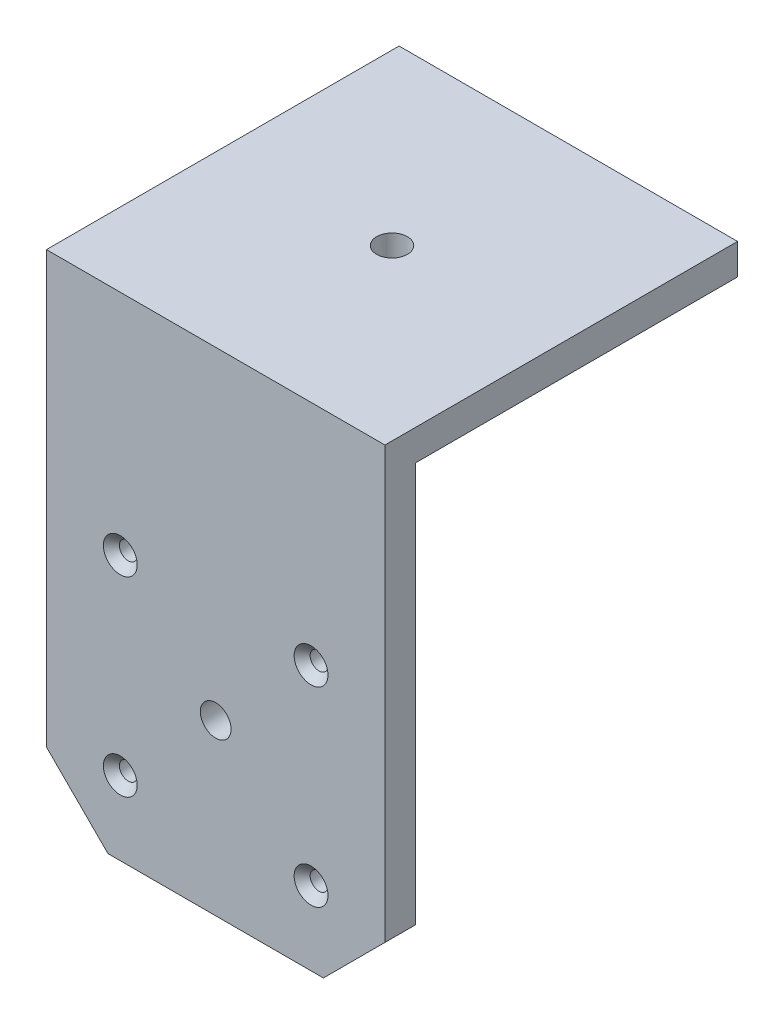
ISO-10303-21;
HEADER;
FILE_DESCRIPTION(('STEP AP214'),'2;1');
FILE_NAME('part.step','',(''),(''),'','','');
FILE_SCHEMA(('AUTOMOTIVE_DESIGN { 1 0 10303 214 1 1 1 1 }'));
ENDSEC;
DATA;
#1=APPLICATION_CONTEXT('core data for automotive mechanical design processes');
#2=APPLICATION_PROTOCOL_DEFINITION('international standard','automotive_design',2000,#1);
#3=PRODUCT_CONTEXT('',#1,'mechanical');
#4=PRODUCT('Part','Part','',(#3));
#5=PRODUCT_RELATED_PRODUCT_CATEGORY('part','',(#4));
#6=PRODUCT_DEFINITION_FORMATION('','',#4);
#7=PRODUCT_DEFINITION_CONTEXT('part definition',#1,'design');
#8=PRODUCT_DEFINITION('design','',#6,#7);
#9=PRODUCT_DEFINITION_SHAPE('','',#8);
#10=(LENGTH_UNIT() NAMED_UNIT(*) SI_UNIT(.MILLI.,.METRE.));
#11=(NAMED_UNIT(*) PLANE_ANGLE_UNIT() SI_UNIT($,.RADIAN.));
#12=(NAMED_UNIT(*) SI_UNIT($,.STERADIAN.) SOLID_ANGLE_UNIT());
#13=UNCERTAINTY_MEASURE_WITH_UNIT(LENGTH_MEASURE(1.E-05),#10,'distance_accuracy_value','');
#14=(GEOMETRIC_REPRESENTATION_CONTEXT(3) GLOBAL_UNCERTAINTY_ASSIGNED_CONTEXT((#13)) GLOBAL_UNIT_ASSIGNED_CONTEXT((#10,
#11,#12)) REPRESENTATION_CONTEXT('',''));
#15=CARTESIAN_POINT('',(0.,0.,0.));
#16=DIRECTION('',(0.,0.,1.));
#17=DIRECTION('',(1.,0.,0.));
#18=AXIS2_PLACEMENT_3D('',#15,#16,#17);
#19=CARTESIAN_POINT('',(-27.5,5.,28.65));
#20=DIRECTION('',(0.,0.,-1.));
#21=DIRECTION('',(-1.,0.,0.));
#22=AXIS2_PLACEMENT_3D('',#19,#20,#21);
#23=PLANE('',#22);
#24=DIRECTION('',(-1.,0.,0.));
#25=VECTOR('',#24,1.);
#26=CARTESIAN_POINT('',(-27.5,-75.,28.65));
#27=LINE('',#26,#25);
#28=CARTESIAN_POINT('',(17.5,-75.,28.65));
#29=VERTEX_POINT('',#28);
#30=CARTESIAN_POINT('',(-17.5,-75.,28.65));
#31=VERTEX_POINT('',#30);
#32=EDGE_CURVE('E191',#29,#31,#27,.T.);
#33=ORIENTED_EDGE('',*,*,#32,.F.);
#34=DIRECTION('',(-0.707106781186547,-0.707106781186549,0.));
#35=VECTOR('',#34,1.);
#36=CARTESIAN_POINT('',(27.5,-65.,28.65));
#37=LINE('',#36,#35);
#38=CARTESIAN_POINT('',(27.5,-65.,28.65));
#39=VERTEX_POINT('',#38);
#40=EDGE_CURVE('E51',#39,#29,#37,.T.);
#41=ORIENTED_EDGE('',*,*,#40,.F.);
#42=DIRECTION('',(0.,-1.,0.));
#43=VECTOR('',#42,1.);
#44=CARTESIAN_POINT('',(27.5,5.,28.65));
#45=LINE('',#44,#43);
#46=CARTESIAN_POINT('',(27.5,5.,28.65));
#47=VERTEX_POINT('',#46);
#48=EDGE_CURVE('E271',#47,#39,#45,.T.);
#49=ORIENTED_EDGE('',*,*,#48,.F.);
#50=DIRECTION('',(1.,0.,0.));
#51=VECTOR('',#50,1.);
#52=CARTESIAN_POINT('',(-27.5,5.,28.65));
#53=LINE('',#52,#51);
#54=CARTESIAN_POINT('',(-27.5,5.,28.65));
#55=VERTEX_POINT('',#54);
#56=EDGE_CURVE('E278',#55,#47,#53,.T.);
#57=ORIENTED_EDGE('',*,*,#56,.F.);
#58=DIRECTION('',(0.,-1.,0.));
#59=VECTOR('',#58,1.);
#60=CARTESIAN_POINT('',(-27.5,5.,28.65));
#61=LINE('',#60,#59);
#62=CARTESIAN_POINT('',(-27.5,-65.,28.65));
#63=VERTEX_POINT('',#62);
#64=EDGE_CURVE('E283',#55,#63,#61,.T.);
#65=ORIENTED_EDGE('',*,*,#64,.T.);
#66=DIRECTION('',(-0.707106781186548,0.707106781186547,0.));
#67=VECTOR('',#66,1.);
#68=CARTESIAN_POINT('',(-17.5,-75.,28.65));
#69=LINE('',#68,#67);
#70=EDGE_CURVE('E180',#31,#63,#69,.T.);
#71=ORIENTED_EDGE('',*,*,#70,.F.);
#72=EDGE_LOOP('',(#33,#41,#49,#57,#65,#71));
#73=FACE_BOUND('',#72,.T.);
#74=CARTESIAN_POINT('',(0.,-47.5,28.65));
#75=DIRECTION('',(0.,0.,1.));
#76=DIRECTION('',(1.,0.,0.));
#77=AXIS2_PLACEMENT_3D('',#74,#75,#76);
#78=CIRCLE('',#77,2.5);
#79=CARTESIAN_POINT('',(2.5,-47.5,28.65));
#80=VERTEX_POINT('',#79);
#81=EDGE_CURVE('E166',#80,#80,#78,.T.);
#82=ORIENTED_EDGE('',*,*,#81,.F.);
#83=EDGE_LOOP('',(#82));
#84=FACE_BOUND('',#83,.T.);
#85=CARTESIAN_POINT('',(15.5,-63.,28.65));
#86=DIRECTION('',(0.,0.,1.));
#87=DIRECTION('',(1.,0.,0.));
#88=AXIS2_PLACEMENT_3D('',#85,#86,#87);
#89=CIRCLE('',#88,2.75);
#90=CARTESIAN_POINT('',(18.25,-63.,28.65));
#91=VERTEX_POINT('',#90);
#92=EDGE_CURVE('E154',#91,#91,#89,.T.);
#93=ORIENTED_EDGE('',*,*,#92,.F.);
#94=EDGE_LOOP('',(#93));
#95=FACE_BOUND('',#94,.T.);
#96=CARTESIAN_POINT('',(-15.5,-63.,28.65));
#97=DIRECTION('',(0.,0.,1.));
#98=DIRECTION('',(1.,0.,0.));
#99=AXIS2_PLACEMENT_3D('',#96,#97,#98);
#100=CIRCLE('',#99,2.75);
#101=CARTESIAN_POINT('',(-12.75,-63.,28.65));
#102=VERTEX_POINT('',#101);
#103=EDGE_CURVE('E145',#102,#102,#100,.T.);
#104=ORIENTED_EDGE('',*,*,#103,.F.);
#105=EDGE_LOOP('',(#104));
#106=FACE_BOUND('',#105,.T.);
#107=CARTESIAN_POINT('',(15.5,-32.,28.65));
#108=DIRECTION('',(0.,0.,1.));
#109=DIRECTION('',(1.,0.,0.));
#110=AXIS2_PLACEMENT_3D('',#107,#108,#109);
#111=CIRCLE('',#110,2.75);
#112=CARTESIAN_POINT('',(18.25,-32.,28.65));
#113=VERTEX_POINT('',#112);
#114=EDGE_CURVE('E136',#113,#113,#111,.T.);
#115=ORIENTED_EDGE('',*,*,#114,.F.);
#116=EDGE_LOOP('',(#115));
#117=FACE_BOUND('',#116,.T.);
#118=CARTESIAN_POINT('',(-15.5,-32.,28.65));
#119=DIRECTION('',(0.,0.,1.));
#120=DIRECTION('',(1.,0.,0.));
#121=AXIS2_PLACEMENT_3D('',#118,#119,#120);
#122=CIRCLE('',#121,2.75);
#123=CARTESIAN_POINT('',(-12.75,-32.,28.65));
#124=VERTEX_POINT('',#123);
#125=EDGE_CURVE('E127',#124,#124,#122,.T.);
#126=ORIENTED_EDGE('',*,*,#125,.F.);
#127=EDGE_LOOP('',(#126));
#128=FACE_BOUND('',#127,.T.);
#129=ADVANCED_FACE('F33',(#73,#84,#95,#106,#117,#128),#23,.F.);
#130=CARTESIAN_POINT('',(0.,0.,0.));
#131=DIRECTION('',(0.,1.,0.));
#132=DIRECTION('',(0.,0.,1.));
#133=AXIS2_PLACEMENT_3D('',#130,#131,#132);
#134=PLANE('',#133);
#135=CARTESIAN_POINT('',(15.5000000000002,0.,-16.15));
#136=DIRECTION('',(0.,-1.,0.));
#137=DIRECTION('',(0.,0.,-1.));
#138=AXIS2_PLACEMENT_3D('',#135,#136,#137);
#139=CIRCLE('',#138,1.4351);
#140=CARTESIAN_POINT('',(15.5000000000002,0.,-17.5851));
#141=VERTEX_POINT('',#140);
#142=EDGE_CURVE('E117',#141,#141,#139,.T.);
#143=ORIENTED_EDGE('',*,*,#142,.F.);
#144=EDGE_LOOP('',(#143));
#145=FACE_BOUND('',#144,.T.);
#146=CARTESIAN_POINT('',(-15.4999999999998,0.,-16.15));
#147=DIRECTION('',(0.,-1.,0.));
#148=DIRECTION('',(0.,0.,-1.));
#149=AXIS2_PLACEMENT_3D('',#146,#147,#148);
#150=CIRCLE('',#149,1.4351);
#151=CARTESIAN_POINT('',(-15.4999999999998,0.,-17.5851));
#152=VERTEX_POINT('',#151);
#153=EDGE_CURVE('E116',#152,#152,#150,.T.);
#154=ORIENTED_EDGE('',*,*,#153,.F.);
#155=EDGE_LOOP('',(#154));
#156=FACE_BOUND('',#155,.T.);
#157=CARTESIAN_POINT('',(0.,0.,0.));
#158=DIRECTION('',(0.,1.,0.));
#159=DIRECTION('',(0.,0.,1.));
#160=AXIS2_PLACEMENT_3D('',#157,#158,#159);
#161=CIRCLE('',#160,2.5);
#162=CARTESIAN_POINT('',(0.,0.,2.5));
#163=VERTEX_POINT('',#162);
#164=EDGE_CURVE('E209',#163,#163,#161,.T.);
#165=ORIENTED_EDGE('',*,*,#164,.T.);
#166=EDGE_LOOP('',(#165));
#167=FACE_BOUND('',#166,.T.);
#168=DIRECTION('',(0.,0.,1.));
#169=VECTOR('',#168,1.);
#170=CARTESIAN_POINT('',(-27.5,0.,-28.65));
#171=LINE('',#170,#169);
#172=CARTESIAN_POINT('',(-27.5,0.,-28.65));
#173=VERTEX_POINT('',#172);
#174=CARTESIAN_POINT('',(-27.5,0.,23.65));
#175=VERTEX_POINT('',#174);
#176=EDGE_CURVE('E206',#173,#175,#171,.T.);
#177=ORIENTED_EDGE('',*,*,#176,.F.);
#178=DIRECTION('',(1.,0.,0.));
#179=VECTOR('',#178,1.);
#180=CARTESIAN_POINT('',(-27.5,0.,-28.65));
#181=LINE('',#180,#179);
#182=CARTESIAN_POINT('',(27.5,0.,-28.65));
#183=VERTEX_POINT('',#182);
#184=EDGE_CURVE('E163',#173,#183,#181,.T.);
#185=ORIENTED_EDGE('',*,*,#184,.T.);
#186=DIRECTION('',(0.,0.,-1.));
#187=VECTOR('',#186,1.);
#188=CARTESIAN_POINT('',(27.5,0.,-28.65));
#189=LINE('',#188,#187);
#190=CARTESIAN_POINT('',(27.5,0.,23.65));
#191=VERTEX_POINT('',#190);
#192=EDGE_CURVE('E200',#191,#183,#189,.T.);
#193=ORIENTED_EDGE('',*,*,#192,.F.);
#194=DIRECTION('',(1.,0.,0.));
#195=VECTOR('',#194,1.);
#196=CARTESIAN_POINT('',(-27.5,0.,23.65));
#197=LINE('',#196,#195);
#198=EDGE_CURVE('E186',#175,#191,#197,.T.);
#199=ORIENTED_EDGE('',*,*,#198,.F.);
#200=EDGE_LOOP('',(#177,#185,#193,#199));
#201=FACE_BOUND('',#200,.T.);
#202=ADVANCED_FACE('F223',(#145,#156,#167,#201),#134,.F.);
#203=CARTESIAN_POINT('',(0.,5.,0.));
#204=DIRECTION('',(0.,1.,0.));
#205=DIRECTION('',(0.,0.,1.));
#206=AXIS2_PLACEMENT_3D('',#203,#204,#205);
#207=PLANE('',#206);
#208=DIRECTION('',(0.,0.,-1.));
#209=VECTOR('',#208,1.);
#210=CARTESIAN_POINT('',(27.5,5.,-28.65));
#211=LINE('',#210,#209);
#212=CARTESIAN_POINT('',(27.5,5.,-28.65));
#213=VERTEX_POINT('',#212);
#214=EDGE_CURVE('E269',#47,#213,#211,.T.);
#215=ORIENTED_EDGE('',*,*,#214,.T.);
#216=DIRECTION('',(-1.,0.,0.));
#217=VECTOR('',#216,1.);
#218=CARTESIAN_POINT('',(-27.5,5.,-28.65));
#219=LINE('',#218,#217);
#220=CARTESIAN_POINT('',(-27.5,5.,-28.65));
#221=VERTEX_POINT('',#220);
#222=EDGE_CURVE('E266',#213,#221,#219,.T.);
#223=ORIENTED_EDGE('',*,*,#222,.T.);
#224=DIRECTION('',(0.,0.,1.));
#225=VECTOR('',#224,1.);
#226=CARTESIAN_POINT('',(-27.5,5.,-28.65));
#227=LINE('',#226,#225);
#228=EDGE_CURVE('E274',#221,#55,#227,.T.);
#229=ORIENTED_EDGE('',*,*,#228,.T.);
#230=ORIENTED_EDGE('',*,*,#56,.T.);
#231=EDGE_LOOP('',(#215,#223,#229,#230));
#232=FACE_BOUND('',#231,.T.);
#233=CARTESIAN_POINT('',(0.,5.,0.));
#234=DIRECTION('',(0.,1.,0.));
#235=DIRECTION('',(0.,0.,1.));
#236=AXIS2_PLACEMENT_3D('',#233,#234,#235);
#237=CIRCLE('',#236,2.5);
#238=CARTESIAN_POINT('',(0.,5.,2.5));
#239=VERTEX_POINT('',#238);
#240=EDGE_CURVE('E195',#239,#239,#237,.T.);
#241=ORIENTED_EDGE('',*,*,#240,.F.);
#242=EDGE_LOOP('',(#241));
#243=FACE_BOUND('',#242,.T.);
#244=ADVANCED_FACE('F250',(#232,#243),#207,.T.);
#245=CARTESIAN_POINT('',(27.5,5.,-28.65));
#246=DIRECTION('',(-1.,0.,0.));
#247=DIRECTION('',(0.,0.,1.));
#248=AXIS2_PLACEMENT_3D('',#245,#246,#247);
#249=PLANE('',#248);
#250=ORIENTED_EDGE('',*,*,#192,.T.);
#251=DIRECTION('',(0.,-1.,0.));
#252=VECTOR('',#251,1.);
#253=CARTESIAN_POINT('',(27.5,5.,-28.65));
#254=LINE('',#253,#252);
#255=EDGE_CURVE('E11',#213,#183,#254,.T.);
#256=ORIENTED_EDGE('',*,*,#255,.F.);
#257=ORIENTED_EDGE('',*,*,#214,.F.);
#258=ORIENTED_EDGE('',*,*,#48,.T.);
#259=DIRECTION('',(0.,0.,1.));
#260=VECTOR('',#259,1.);
#261=CARTESIAN_POINT('',(27.5,-65.,-28.651));
#262=LINE('',#261,#260);
#263=CARTESIAN_POINT('',(27.5,-65.,23.65));
#264=VERTEX_POINT('',#263);
#265=EDGE_CURVE('E175',#264,#39,#262,.T.);
#266=ORIENTED_EDGE('',*,*,#265,.F.);
#267=DIRECTION('',(0.,1.,0.));
#268=VECTOR('',#267,1.);
#269=CARTESIAN_POINT('',(27.5,-75.,23.65));
#270=LINE('',#269,#268);
#271=EDGE_CURVE('E37',#264,#191,#270,.T.);
#272=ORIENTED_EDGE('',*,*,#271,.T.);
#273=EDGE_LOOP('',(#250,#256,#257,#258,#266,#272));
#274=FACE_BOUND('',#273,.T.);
#275=ADVANCED_FACE('F35',(#274),#249,.F.);
#276=CARTESIAN_POINT('',(-27.5,5.,-28.65));
#277=DIRECTION('',(0.,0.,1.));
#278=DIRECTION('',(1.,0.,0.));
#279=AXIS2_PLACEMENT_3D('',#276,#277,#278);
#280=PLANE('',#279);
#281=ORIENTED_EDGE('',*,*,#255,.T.);
#282=ORIENTED_EDGE('',*,*,#184,.F.);
#283=DIRECTION('',(0.,-1.,0.));
#284=VECTOR('',#283,1.);
#285=CARTESIAN_POINT('',(-27.5,5.,-28.65));
#286=LINE('',#285,#284);
#287=EDGE_CURVE('E43',#221,#173,#286,.T.);
#288=ORIENTED_EDGE('',*,*,#287,.F.);
#289=ORIENTED_EDGE('',*,*,#222,.F.);
#290=EDGE_LOOP('',(#281,#282,#288,#289));
#291=FACE_BOUND('',#290,.T.);
#292=ADVANCED_FACE('F257',(#291),#280,.F.);
#293=CARTESIAN_POINT('',(-27.5,5.,-28.65));
#294=DIRECTION('',(1.,0.,0.));
#295=DIRECTION('',(0.,0.,-1.));
#296=AXIS2_PLACEMENT_3D('',#293,#294,#295);
#297=PLANE('',#296);
#298=ORIENTED_EDGE('',*,*,#287,.T.);
#299=ORIENTED_EDGE('',*,*,#176,.T.);
#300=DIRECTION('',(0.,1.,0.));
#301=VECTOR('',#300,1.);
#302=CARTESIAN_POINT('',(-27.5,-75.,23.65));
#303=LINE('',#302,#301);
#304=CARTESIAN_POINT('',(-27.5,-65.,23.65));
#305=VERTEX_POINT('',#304);
#306=EDGE_CURVE('E208',#305,#175,#303,.T.);
#307=ORIENTED_EDGE('',*,*,#306,.F.);
#308=DIRECTION('',(0.,0.,1.));
#309=VECTOR('',#308,1.);
#310=CARTESIAN_POINT('',(-27.5,-65.,-28.651));
#311=LINE('',#310,#309);
#312=EDGE_CURVE('E183',#305,#63,#311,.T.);
#313=ORIENTED_EDGE('',*,*,#312,.T.);
#314=ORIENTED_EDGE('',*,*,#64,.F.);
#315=ORIENTED_EDGE('',*,*,#228,.F.);
#316=EDGE_LOOP('',(#298,#299,#307,#313,#314,#315));
#317=FACE_BOUND('',#316,.T.);
#318=ADVANCED_FACE('F240',(#317),#297,.F.);
#319=CARTESIAN_POINT('',(0.,5.,0.));
#320=DIRECTION('',(0.,-1.,0.));
#321=DIRECTION('',(0.,0.,-1.));
#322=AXIS2_PLACEMENT_3D('',#319,#320,#321);
#323=CYLINDRICAL_SURFACE('',#322,2.5);
#324=ORIENTED_EDGE('',*,*,#240,.T.);
#325=EDGE_LOOP('',(#324));
#326=FACE_BOUND('',#325,.T.);
#327=ORIENTED_EDGE('',*,*,#164,.F.);
#328=EDGE_LOOP('',(#327));
#329=FACE_BOUND('',#328,.T.);
#330=ADVANCED_FACE('F228',(#326,#329),#323,.F.);
#331=CARTESIAN_POINT('',(-27.5,-75.,23.65));
#332=DIRECTION('',(0.,0.,1.));
#333=DIRECTION('',(1.,0.,0.));
#334=AXIS2_PLACEMENT_3D('',#331,#332,#333);
#335=PLANE('',#334);
#336=CARTESIAN_POINT('',(-15.5,-32.,23.65));
#337=DIRECTION('',(0.,0.,1.));
#338=DIRECTION('',(1.,0.,0.));
#339=AXIS2_PLACEMENT_3D('',#336,#337,#338);
#340=CIRCLE('',#339,1.44999999999999);
#341=CARTESIAN_POINT('',(-14.05,-32.,23.65));
#342=VERTEX_POINT('',#341);
#343=EDGE_CURVE('E133',#342,#342,#340,.T.);
#344=ORIENTED_EDGE('',*,*,#343,.T.);
#345=EDGE_LOOP('',(#344));
#346=FACE_BOUND('',#345,.T.);
#347=CARTESIAN_POINT('',(15.5,-32.,23.65));
#348=DIRECTION('',(0.,0.,1.));
#349=DIRECTION('',(1.,0.,0.));
#350=AXIS2_PLACEMENT_3D('',#347,#348,#349);
#351=CIRCLE('',#350,1.44999999999999);
#352=CARTESIAN_POINT('',(16.95,-32.,23.65));
#353=VERTEX_POINT('',#352);
#354=EDGE_CURVE('E142',#353,#353,#351,.T.);
#355=ORIENTED_EDGE('',*,*,#354,.T.);
#356=EDGE_LOOP('',(#355));
#357=FACE_BOUND('',#356,.T.);
#358=CARTESIAN_POINT('',(-15.5,-63.,23.65));
#359=DIRECTION('',(0.,0.,1.));
#360=DIRECTION('',(1.,0.,0.));
#361=AXIS2_PLACEMENT_3D('',#358,#359,#360);
#362=CIRCLE('',#361,1.44999999999999);
#363=CARTESIAN_POINT('',(-14.05,-63.,23.65));
#364=VERTEX_POINT('',#363);
#365=EDGE_CURVE('E151',#364,#364,#362,.T.);
#366=ORIENTED_EDGE('',*,*,#365,.T.);
#367=EDGE_LOOP('',(#366));
#368=FACE_BOUND('',#367,.T.);
#369=CARTESIAN_POINT('',(15.5,-63.,23.65));
#370=DIRECTION('',(0.,0.,1.));
#371=DIRECTION('',(1.,0.,0.));
#372=AXIS2_PLACEMENT_3D('',#369,#370,#371);
#373=CIRCLE('',#372,1.44999999999999);
#374=CARTESIAN_POINT('',(16.95,-63.,23.65));
#375=VERTEX_POINT('',#374);
#376=EDGE_CURVE('E160',#375,#375,#373,.T.);
#377=ORIENTED_EDGE('',*,*,#376,.T.);
#378=EDGE_LOOP('',(#377));
#379=FACE_BOUND('',#378,.T.);
#380=CARTESIAN_POINT('',(0.,-47.5,23.65));
#381=DIRECTION('',(0.,0.,1.));
#382=DIRECTION('',(1.,0.,0.));
#383=AXIS2_PLACEMENT_3D('',#380,#381,#382);
#384=CIRCLE('',#383,2.5);
#385=CARTESIAN_POINT('',(2.5,-47.5,23.65));
#386=VERTEX_POINT('',#385);
#387=EDGE_CURVE('E169',#386,#386,#384,.F.);
#388=ORIENTED_EDGE('',*,*,#387,.F.);
#389=EDGE_LOOP('',(#388));
#390=FACE_BOUND('',#389,.T.);
#391=ORIENTED_EDGE('',*,*,#271,.F.);
#392=DIRECTION('',(0.707106781186547,0.707106781186548,0.));
#393=VECTOR('',#392,1.);
#394=CARTESIAN_POINT('',(27.5,-65.,23.65));
#395=LINE('',#394,#393);
#396=CARTESIAN_POINT('',(17.5,-75.,23.65));
#397=VERTEX_POINT('',#396);
#398=EDGE_CURVE('E172',#397,#264,#395,.T.);
#399=ORIENTED_EDGE('',*,*,#398,.F.);
#400=DIRECTION('',(1.,0.,0.));
#401=VECTOR('',#400,1.);
#402=CARTESIAN_POINT('',(-27.5,-75.,23.65));
#403=LINE('',#402,#401);
#404=CARTESIAN_POINT('',(-17.5,-75.,23.65));
#405=VERTEX_POINT('',#404);
#406=EDGE_CURVE('E188',#405,#397,#403,.T.);
#407=ORIENTED_EDGE('',*,*,#406,.F.);
#408=DIRECTION('',(0.707106781186548,-0.707106781186547,0.));
#409=VECTOR('',#408,1.);
#410=CARTESIAN_POINT('',(-17.5,-75.,23.65));
#411=LINE('',#410,#409);
#412=EDGE_CURVE('E59',#305,#405,#411,.T.);
#413=ORIENTED_EDGE('',*,*,#412,.F.);
#414=ORIENTED_EDGE('',*,*,#306,.T.);
#415=ORIENTED_EDGE('',*,*,#198,.T.);
#416=EDGE_LOOP('',(#391,#399,#407,#413,#414,#415));
#417=FACE_BOUND('',#416,.T.);
#418=ADVANCED_FACE('F225',(#346,#357,#368,#379,#390,#417),#335,.F.);
#419=CARTESIAN_POINT('',(0.,-75.,0.));
#420=DIRECTION('',(0.,-1.,0.));
#421=DIRECTION('',(0.,0.,-1.));
#422=AXIS2_PLACEMENT_3D('',#419,#420,#421);
#423=PLANE('',#422);
#424=DIRECTION('',(0.,0.,1.));
#425=VECTOR('',#424,1.);
#426=CARTESIAN_POINT('',(17.5,-75.,-28.651));
#427=LINE('',#426,#425);
#428=EDGE_CURVE('E176',#397,#29,#427,.T.);
#429=ORIENTED_EDGE('',*,*,#428,.T.);
#430=ORIENTED_EDGE('',*,*,#32,.T.);
#431=DIRECTION('',(0.,0.,1.));
#432=VECTOR('',#431,1.);
#433=CARTESIAN_POINT('',(-17.5,-75.,-28.651));
#434=LINE('',#433,#432);
#435=EDGE_CURVE('E182',#405,#31,#434,.T.);
#436=ORIENTED_EDGE('',*,*,#435,.F.);
#437=ORIENTED_EDGE('',*,*,#406,.T.);
#438=EDGE_LOOP('',(#429,#430,#436,#437));
#439=FACE_BOUND('',#438,.T.);
#440=ADVANCED_FACE('F227',(#439),#423,.T.);
#441=CARTESIAN_POINT('',(-17.5,-75.,-28.651));
#442=DIRECTION('',(0.707106781186547,0.707106781186548,0.));
#443=DIRECTION('',(-0.707106781186548,0.707106781186547,0.));
#444=AXIS2_PLACEMENT_3D('',#441,#442,#443);
#445=PLANE('',#444);
#446=ORIENTED_EDGE('',*,*,#412,.T.);
#447=ORIENTED_EDGE('',*,*,#435,.T.);
#448=ORIENTED_EDGE('',*,*,#70,.T.);
#449=ORIENTED_EDGE('',*,*,#312,.F.);
#450=EDGE_LOOP('',(#446,#447,#448,#449));
#451=FACE_BOUND('',#450,.T.);
#452=ADVANCED_FACE('F236',(#451),#445,.F.);
#453=CARTESIAN_POINT('',(27.5,-65.,-28.651));
#454=DIRECTION('',(-0.707106781186548,0.707106781186547,0.));
#455=DIRECTION('',(-0.707106781186547,-0.707106781186548,0.));
#456=AXIS2_PLACEMENT_3D('',#453,#454,#455);
#457=PLANE('',#456);
#458=ORIENTED_EDGE('',*,*,#398,.T.);
#459=ORIENTED_EDGE('',*,*,#265,.T.);
#460=ORIENTED_EDGE('',*,*,#40,.T.);
#461=ORIENTED_EDGE('',*,*,#428,.F.);
#462=EDGE_LOOP('',(#458,#459,#460,#461));
#463=FACE_BOUND('',#462,.T.);
#464=ADVANCED_FACE('F292',(#463),#457,.F.);
#465=CARTESIAN_POINT('',(0.,-47.5,-28.651));
#466=DIRECTION('',(0.,0.,1.));
#467=DIRECTION('',(1.,0.,0.));
#468=AXIS2_PLACEMENT_3D('',#465,#466,#467);
#469=CYLINDRICAL_SURFACE('',#468,2.5);
#470=ORIENTED_EDGE('',*,*,#81,.T.);
#471=EDGE_LOOP('',(#470));
#472=FACE_BOUND('',#471,.T.);
#473=ORIENTED_EDGE('',*,*,#387,.T.);
#474=EDGE_LOOP('',(#473));
#475=FACE_BOUND('',#474,.T.);
#476=ADVANCED_FACE('F294',(#472,#475),#469,.F.);
#477=CARTESIAN_POINT('',(15.5,-63.,28.65));
#478=DIRECTION('',(0.,0.,1.));
#479=DIRECTION('',(1.,0.,0.));
#480=AXIS2_PLACEMENT_3D('',#477,#478,#479);
#481=CYLINDRICAL_SURFACE('',#480,1.44999999999999);
#482=ORIENTED_EDGE('',*,*,#376,.F.);
#483=EDGE_LOOP('',(#482));
#484=FACE_BOUND('',#483,.T.);
#485=CARTESIAN_POINT('',(15.5,-63.,27.35));
#486=DIRECTION('',(0.,0.,1.));
#487=DIRECTION('',(1.,0.,0.));
#488=AXIS2_PLACEMENT_3D('',#485,#486,#487);
#489=CIRCLE('',#488,1.44999999999999);
#490=CARTESIAN_POINT('',(16.95,-63.,27.35));
#491=VERTEX_POINT('',#490);
#492=EDGE_CURVE('E157',#491,#491,#489,.T.);
#493=ORIENTED_EDGE('',*,*,#492,.T.);
#494=EDGE_LOOP('',(#493));
#495=FACE_BOUND('',#494,.T.);
#496=ADVANCED_FACE('F300',(#484,#495),#481,.F.);
#497=CARTESIAN_POINT('',(15.5,-63.,28.65));
#498=DIRECTION('',(0.,0.,1.));
#499=DIRECTION('',(1.,0.,0.));
#500=AXIS2_PLACEMENT_3D('',#497,#498,#499);
#501=CONICAL_SURFACE('',#500,2.75,0.785398163397448);
#502=ORIENTED_EDGE('',*,*,#492,.F.);
#503=EDGE_LOOP('',(#502));
#504=FACE_BOUND('',#503,.T.);
#505=ORIENTED_EDGE('',*,*,#92,.T.);
#506=EDGE_LOOP('',(#505));
#507=FACE_BOUND('',#506,.T.);
#508=ADVANCED_FACE('F307',(#504,#507),#501,.F.);
#509=CARTESIAN_POINT('',(-15.5,-63.,28.65));
#510=DIRECTION('',(0.,0.,1.));
#511=DIRECTION('',(1.,0.,0.));
#512=AXIS2_PLACEMENT_3D('',#509,#510,#511);
#513=CYLINDRICAL_SURFACE('',#512,1.44999999999999);
#514=ORIENTED_EDGE('',*,*,#365,.F.);
#515=EDGE_LOOP('',(#514));
#516=FACE_BOUND('',#515,.T.);
#517=CARTESIAN_POINT('',(-15.5,-63.,27.35));
#518=DIRECTION('',(0.,0.,1.));
#519=DIRECTION('',(1.,0.,0.));
#520=AXIS2_PLACEMENT_3D('',#517,#518,#519);
#521=CIRCLE('',#520,1.44999999999999);
#522=CARTESIAN_POINT('',(-14.05,-63.,27.35));
#523=VERTEX_POINT('',#522);
#524=EDGE_CURVE('E148',#523,#523,#521,.T.);
#525=ORIENTED_EDGE('',*,*,#524,.T.);
#526=EDGE_LOOP('',(#525));
#527=FACE_BOUND('',#526,.T.);
#528=ADVANCED_FACE('F311',(#516,#527),#513,.F.);
#529=CARTESIAN_POINT('',(-15.5,-63.,28.65));
#530=DIRECTION('',(0.,0.,1.));
#531=DIRECTION('',(1.,0.,0.));
#532=AXIS2_PLACEMENT_3D('',#529,#530,#531);
#533=CONICAL_SURFACE('',#532,2.75,0.785398163397449);
#534=ORIENTED_EDGE('',*,*,#524,.F.);
#535=EDGE_LOOP('',(#534));
#536=FACE_BOUND('',#535,.T.);
#537=ORIENTED_EDGE('',*,*,#103,.T.);
#538=EDGE_LOOP('',(#537));
#539=FACE_BOUND('',#538,.T.);
#540=ADVANCED_FACE('F315',(#536,#539),#533,.F.);
#541=CARTESIAN_POINT('',(15.5,-32.,28.65));
#542=DIRECTION('',(0.,0.,1.));
#543=DIRECTION('',(1.,0.,0.));
#544=AXIS2_PLACEMENT_3D('',#541,#542,#543);
#545=CYLINDRICAL_SURFACE('',#544,1.44999999999999);
#546=ORIENTED_EDGE('',*,*,#354,.F.);
#547=EDGE_LOOP('',(#546));
#548=FACE_BOUND('',#547,.T.);
#549=CARTESIAN_POINT('',(15.5,-32.,27.35));
#550=DIRECTION('',(0.,0.,1.));
#551=DIRECTION('',(1.,0.,0.));
#552=AXIS2_PLACEMENT_3D('',#549,#550,#551);
#553=CIRCLE('',#552,1.44999999999999);
#554=CARTESIAN_POINT('',(16.95,-32.,27.35));
#555=VERTEX_POINT('',#554);
#556=EDGE_CURVE('E139',#555,#555,#553,.T.);
#557=ORIENTED_EDGE('',*,*,#556,.T.);
#558=EDGE_LOOP('',(#557));
#559=FACE_BOUND('',#558,.T.);
#560=ADVANCED_FACE('F319',(#548,#559),#545,.F.);
#561=CARTESIAN_POINT('',(15.5,-32.,28.65));
#562=DIRECTION('',(0.,0.,1.));
#563=DIRECTION('',(1.,0.,0.));
#564=AXIS2_PLACEMENT_3D('',#561,#562,#563);
#565=CONICAL_SURFACE('',#564,2.75,0.785398163397448);
#566=ORIENTED_EDGE('',*,*,#556,.F.);
#567=EDGE_LOOP('',(#566));
#568=FACE_BOUND('',#567,.T.);
#569=ORIENTED_EDGE('',*,*,#114,.T.);
#570=EDGE_LOOP('',(#569));
#571=FACE_BOUND('',#570,.T.);
#572=ADVANCED_FACE('F323',(#568,#571),#565,.F.);
#573=CARTESIAN_POINT('',(-15.5,-32.,28.65));
#574=DIRECTION('',(0.,0.,1.));
#575=DIRECTION('',(1.,0.,0.));
#576=AXIS2_PLACEMENT_3D('',#573,#574,#575);
#577=CYLINDRICAL_SURFACE('',#576,1.44999999999999);
#578=ORIENTED_EDGE('',*,*,#343,.F.);
#579=EDGE_LOOP('',(#578));
#580=FACE_BOUND('',#579,.T.);
#581=CARTESIAN_POINT('',(-15.5,-32.,27.35));
#582=DIRECTION('',(0.,0.,1.));
#583=DIRECTION('',(1.,0.,0.));
#584=AXIS2_PLACEMENT_3D('',#581,#582,#583);
#585=CIRCLE('',#584,1.44999999999999);
#586=CARTESIAN_POINT('',(-14.05,-32.,27.35));
#587=VERTEX_POINT('',#586);
#588=EDGE_CURVE('E130',#587,#587,#585,.T.);
#589=ORIENTED_EDGE('',*,*,#588,.T.);
#590=EDGE_LOOP('',(#589));
#591=FACE_BOUND('',#590,.T.);
#592=ADVANCED_FACE('F327',(#580,#591),#577,.F.);
#593=CARTESIAN_POINT('',(-15.5,-32.,28.65));
#594=DIRECTION('',(0.,0.,1.));
#595=DIRECTION('',(1.,0.,0.));
#596=AXIS2_PLACEMENT_3D('',#593,#594,#595);
#597=CONICAL_SURFACE('',#596,2.75,0.785398163397449);
#598=ORIENTED_EDGE('',*,*,#588,.F.);
#599=EDGE_LOOP('',(#598));
#600=FACE_BOUND('',#599,.T.);
#601=ORIENTED_EDGE('',*,*,#125,.T.);
#602=EDGE_LOOP('',(#601));
#603=FACE_BOUND('',#602,.T.);
#604=ADVANCED_FACE('F331',(#600,#603),#597,.F.);
#605=CARTESIAN_POINT('',(-15.4999999999998,3.5,-16.15));
#606=DIRECTION('',(0.,-1.,0.));
#607=DIRECTION('',(0.,0.,-1.));
#608=AXIS2_PLACEMENT_3D('',#605,#606,#607);
#609=CONICAL_SURFACE('',#608,1.4351,1.02974425867665);
#610=CARTESIAN_POINT('',(-15.4999999999998,4.36229507436645,-16.15));
#611=VERTEX_POINT('',#610);
#612=VERTEX_LOOP('',#611);
#613=FACE_BOUND('',#612,.T.);
#614=CARTESIAN_POINT('',(-15.4999999999998,3.5,-16.15));
#615=DIRECTION('',(0.,-1.,0.));
#616=DIRECTION('',(0.,0.,-1.));
#617=AXIS2_PLACEMENT_3D('',#614,#615,#616);
#618=CIRCLE('',#617,1.4351);
#619=CARTESIAN_POINT('',(-15.4999999999998,3.5,-17.5851));
#620=VERTEX_POINT('',#619);
#621=EDGE_CURVE('E120',#620,#620,#618,.T.);
#622=ORIENTED_EDGE('',*,*,#621,.T.);
#623=EDGE_LOOP('',(#622));
#624=FACE_BOUND('',#623,.T.);
#625=ADVANCED_FACE('F335',(#613,#624),#609,.F.);
#626=CARTESIAN_POINT('',(-15.4999999999998,0.,-16.15));
#627=DIRECTION('',(0.,-1.,0.));
#628=DIRECTION('',(0.,0.,-1.));
#629=AXIS2_PLACEMENT_3D('',#626,#627,#628);
#630=CYLINDRICAL_SURFACE('',#629,1.4351);
#631=ORIENTED_EDGE('',*,*,#621,.F.);
#632=EDGE_LOOP('',(#631));
#633=FACE_BOUND('',#632,.T.);
#634=ORIENTED_EDGE('',*,*,#153,.T.);
#635=EDGE_LOOP('',(#634));
#636=FACE_BOUND('',#635,.T.);
#637=ADVANCED_FACE('F110',(#633,#636),#630,.F.);
#638=CARTESIAN_POINT('',(15.5000000000002,3.5,-16.15));
#639=DIRECTION('',(0.,-1.,0.));
#640=DIRECTION('',(0.,0.,-1.));
#641=AXIS2_PLACEMENT_3D('',#638,#639,#640);
#642=CONICAL_SURFACE('',#641,1.4351,1.02974425867665);
#643=CARTESIAN_POINT('',(15.5000000000002,4.36229507436645,-16.15));
#644=VERTEX_POINT('',#643);
#645=VERTEX_LOOP('',#644);
#646=FACE_BOUND('',#645,.T.);
#647=CARTESIAN_POINT('',(15.5000000000002,3.5,-16.15));
#648=DIRECTION('',(0.,-1.,0.));
#649=DIRECTION('',(0.,0.,-1.));
#650=AXIS2_PLACEMENT_3D('',#647,#648,#649);
#651=CIRCLE('',#650,1.4351);
#652=CARTESIAN_POINT('',(15.5000000000002,3.5,-17.5851));
#653=VERTEX_POINT('',#652);
#654=EDGE_CURVE('E114',#653,#653,#651,.T.);
#655=ORIENTED_EDGE('',*,*,#654,.T.);
#656=EDGE_LOOP('',(#655));
#657=FACE_BOUND('',#656,.T.);
#658=ADVANCED_FACE('F106',(#646,#657),#642,.F.);
#659=CARTESIAN_POINT('',(15.5000000000002,0.,-16.15));
#660=DIRECTION('',(0.,-1.,0.));
#661=DIRECTION('',(0.,0.,-1.));
#662=AXIS2_PLACEMENT_3D('',#659,#660,#661);
#663=CYLINDRICAL_SURFACE('',#662,1.4351);
#664=ORIENTED_EDGE('',*,*,#654,.F.);
#665=EDGE_LOOP('',(#664));
#666=FACE_BOUND('',#665,.T.);
#667=ORIENTED_EDGE('',*,*,#142,.T.);
#668=EDGE_LOOP('',(#667));
#669=FACE_BOUND('',#668,.T.);
#670=ADVANCED_FACE('F109',(#666,#669),#663,.F.);
#671=CLOSED_SHELL('',(#129,#202,#244,#275,#292,#318,#330,#418,#440,#452,#464,#476,#496,#508,
#528,#540,#560,#572,#592,#604,#625,#637,#658,#670));
#672=MANIFOLD_SOLID_BREP('B2',#671);
#673=ADVANCED_BREP_SHAPE_REPRESENTATION('',(#18,#672),#14);
#674=SHAPE_DEFINITION_REPRESENTATION(#9,#673);
ENDSEC;
END-ISO-10303-21;
